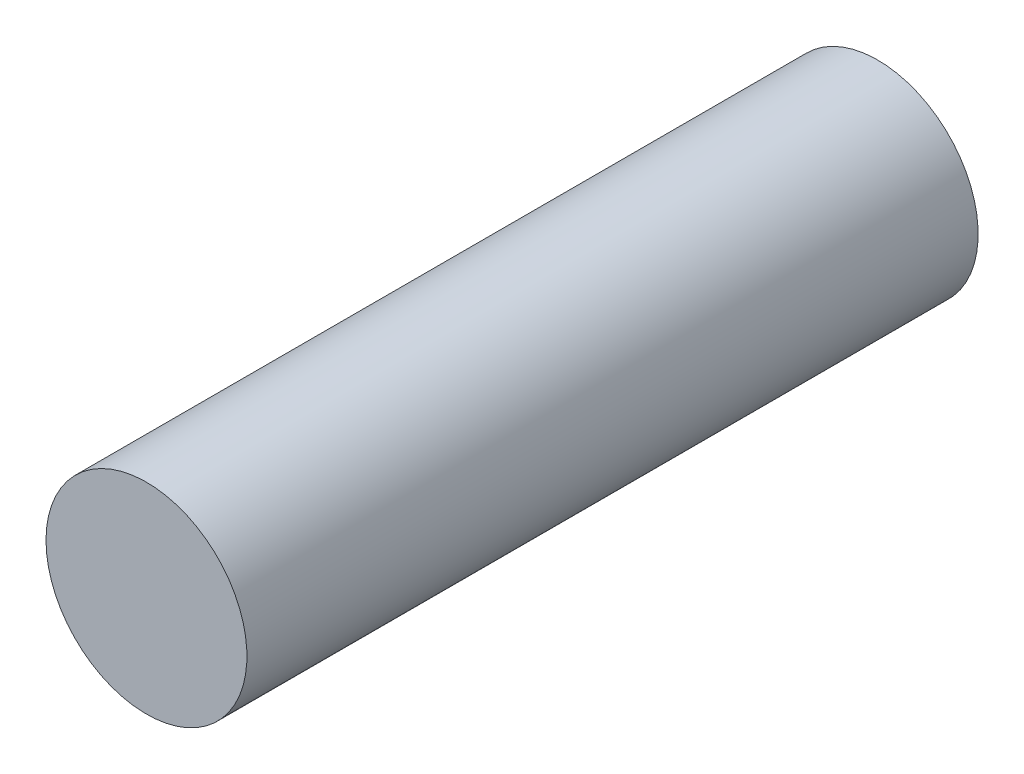
ISO-10303-21;
HEADER;
FILE_DESCRIPTION(('STEP AP214'),'2;1');
FILE_NAME('part.step','',(''),(''),'','','');
FILE_SCHEMA(('AUTOMOTIVE_DESIGN { 1 0 10303 214 1 1 1 1 }'));
ENDSEC;
DATA;
#1=APPLICATION_CONTEXT('core data for automotive mechanical design processes');
#2=APPLICATION_PROTOCOL_DEFINITION('international standard','automotive_design',2000,#1);
#3=PRODUCT_CONTEXT('',#1,'mechanical');
#4=PRODUCT('Part','Part','',(#3));
#5=PRODUCT_RELATED_PRODUCT_CATEGORY('part','',(#4));
#6=PRODUCT_DEFINITION_FORMATION('','',#4);
#7=PRODUCT_DEFINITION_CONTEXT('part definition',#1,'design');
#8=PRODUCT_DEFINITION('design','',#6,#7);
#9=PRODUCT_DEFINITION_SHAPE('','',#8);
#10=(LENGTH_UNIT() NAMED_UNIT(*) SI_UNIT(.MILLI.,.METRE.));
#11=(NAMED_UNIT(*) PLANE_ANGLE_UNIT() SI_UNIT($,.RADIAN.));
#12=(NAMED_UNIT(*) SI_UNIT($,.STERADIAN.) SOLID_ANGLE_UNIT());
#13=UNCERTAINTY_MEASURE_WITH_UNIT(LENGTH_MEASURE(1.E-05),#10,'distance_accuracy_value','');
#14=(GEOMETRIC_REPRESENTATION_CONTEXT(3) GLOBAL_UNCERTAINTY_ASSIGNED_CONTEXT((#13)) GLOBAL_UNIT_ASSIGNED_CONTEXT((#10,
#11,#12)) REPRESENTATION_CONTEXT('',''));
#15=CARTESIAN_POINT('',(0.,0.,0.));
#16=DIRECTION('',(0.,0.,1.));
#17=DIRECTION('',(1.,0.,0.));
#18=AXIS2_PLACEMENT_3D('',#15,#16,#17);
#19=CARTESIAN_POINT('',(0.,0.,149.34));
#20=DIRECTION('',(0.,0.,1.));
#21=DIRECTION('',(1.,0.,0.));
#22=AXIS2_PLACEMENT_3D('',#19,#20,#21);
#23=PLANE('',#22);
#24=CARTESIAN_POINT('',(0.,0.,149.34));
#25=DIRECTION('',(0.,0.,-1.));
#26=DIRECTION('',(-1.,0.,0.));
#27=AXIS2_PLACEMENT_3D('',#24,#25,#26);
#28=CIRCLE('',#27,37.5);
#29=CARTESIAN_POINT('',(-37.5,0.,149.34));
#30=VERTEX_POINT('',#29);
#31=EDGE_CURVE('E17',#30,#30,#28,.T.);
#32=ORIENTED_EDGE('',*,*,#31,.F.);
#33=EDGE_LOOP('',(#32));
#34=FACE_BOUND('',#33,.T.);
#35=ADVANCED_FACE('F14',(#34),#23,.T.);
#36=CARTESIAN_POINT('',(0.,37.5,-123.59));
#37=DIRECTION('',(0.,0.,-1.));
#38=DIRECTION('',(-1.,0.,0.));
#39=AXIS2_PLACEMENT_3D('',#36,#37,#38);
#40=PLANE('',#39);
#41=CARTESIAN_POINT('',(0.,0.,-123.59));
#42=DIRECTION('',(0.,0.,-1.));
#43=DIRECTION('',(-1.,0.,0.));
#44=AXIS2_PLACEMENT_3D('',#41,#42,#43);
#45=CIRCLE('',#44,37.5);
#46=CARTESIAN_POINT('',(-37.5,0.,-123.59));
#47=VERTEX_POINT('',#46);
#48=EDGE_CURVE('E10',#47,#47,#45,.F.);
#49=ORIENTED_EDGE('',*,*,#48,.F.);
#50=EDGE_LOOP('',(#49));
#51=FACE_BOUND('',#50,.T.);
#52=ADVANCED_FACE('F29',(#51),#40,.T.);
#53=CARTESIAN_POINT('',(0.,0.,148.59));
#54=DIRECTION('',(0.,0.,-1.));
#55=DIRECTION('',(-1.,0.,0.));
#56=AXIS2_PLACEMENT_3D('',#53,#54,#55);
#57=CYLINDRICAL_SURFACE('',#56,37.5);
#58=ORIENTED_EDGE('',*,*,#48,.T.);
#59=EDGE_LOOP('',(#58));
#60=FACE_BOUND('',#59,.T.);
#61=ORIENTED_EDGE('',*,*,#31,.T.);
#62=EDGE_LOOP('',(#61));
#63=FACE_BOUND('',#62,.T.);
#64=ADVANCED_FACE('F26',(#60,#63),#57,.T.);
#65=CLOSED_SHELL('',(#35,#52,#64));
#66=MANIFOLD_SOLID_BREP('B1',#65);
#67=ADVANCED_BREP_SHAPE_REPRESENTATION('',(#18,#66),#14);
#68=SHAPE_DEFINITION_REPRESENTATION(#9,#67);
ENDSEC;
END-ISO-10303-21;
